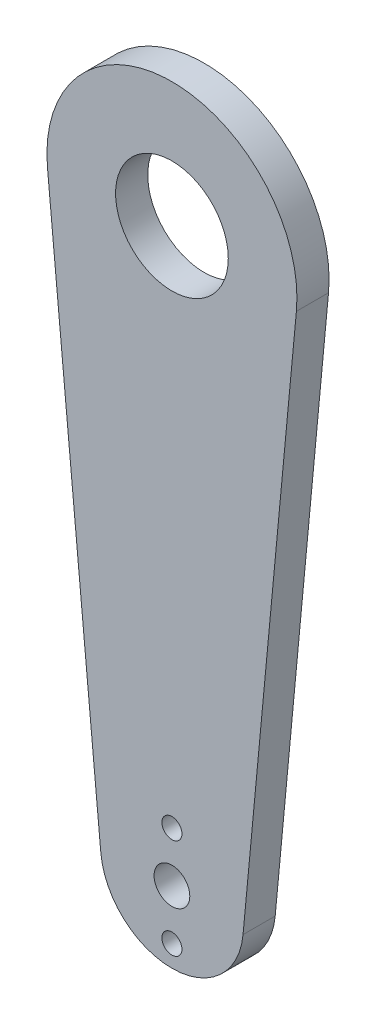
ISO-10303-21;
HEADER;
FILE_DESCRIPTION(('STEP AP214'),'2;1');
FILE_NAME('part.step','',(''),(''),'','','');
FILE_SCHEMA(('AUTOMOTIVE_DESIGN { 1 0 10303 214 1 1 1 1 }'));
ENDSEC;
DATA;
#1=APPLICATION_CONTEXT('core data for automotive mechanical design processes');
#2=APPLICATION_PROTOCOL_DEFINITION('international standard','automotive_design',2000,#1);
#3=PRODUCT_CONTEXT('',#1,'mechanical');
#4=PRODUCT('Part','Part','',(#3));
#5=PRODUCT_RELATED_PRODUCT_CATEGORY('part','',(#4));
#6=PRODUCT_DEFINITION_FORMATION('','',#4);
#7=PRODUCT_DEFINITION_CONTEXT('part definition',#1,'design');
#8=PRODUCT_DEFINITION('design','',#6,#7);
#9=PRODUCT_DEFINITION_SHAPE('','',#8);
#10=(LENGTH_UNIT() NAMED_UNIT(*) SI_UNIT(.MILLI.,.METRE.));
#11=(NAMED_UNIT(*) PLANE_ANGLE_UNIT() SI_UNIT($,.RADIAN.));
#12=(NAMED_UNIT(*) SI_UNIT($,.STERADIAN.) SOLID_ANGLE_UNIT());
#13=UNCERTAINTY_MEASURE_WITH_UNIT(LENGTH_MEASURE(1.E-05),#10,'distance_accuracy_value','');
#14=(GEOMETRIC_REPRESENTATION_CONTEXT(3) GLOBAL_UNCERTAINTY_ASSIGNED_CONTEXT((#13)) GLOBAL_UNIT_ASSIGNED_CONTEXT((#10,
#11,#12)) REPRESENTATION_CONTEXT('',''));
#15=CARTESIAN_POINT('',(0.,0.,0.));
#16=DIRECTION('',(0.,0.,1.));
#17=DIRECTION('',(1.,0.,0.));
#18=AXIS2_PLACEMENT_3D('',#15,#16,#17);
#19=CARTESIAN_POINT('',(0.,0.,4.5));
#20=DIRECTION('',(0.,0.,1.));
#21=DIRECTION('',(1.,0.,0.));
#22=AXIS2_PLACEMENT_3D('',#19,#20,#21);
#23=PLANE('',#22);
#24=CARTESIAN_POINT('',(0.,-7.,4.5));
#25=DIRECTION('',(0.,0.,1.));
#26=DIRECTION('',(1.,0.,0.));
#27=AXIS2_PLACEMENT_3D('',#24,#25,#26);
#28=CIRCLE('',#27,1.4);
#29=CARTESIAN_POINT('',(1.4,-7.,4.5));
#30=VERTEX_POINT('',#29);
#31=EDGE_CURVE('E129',#30,#30,#28,.T.);
#32=ORIENTED_EDGE('',*,*,#31,.F.);
#33=EDGE_LOOP('',(#32));
#34=FACE_BOUND('',#33,.T.);
#35=CARTESIAN_POINT('',(0.,0.,4.5));
#36=DIRECTION('',(0.,0.,1.));
#37=DIRECTION('',(1.,0.,0.));
#38=AXIS2_PLACEMENT_3D('',#35,#36,#37);
#39=CIRCLE('',#38,2.5);
#40=CARTESIAN_POINT('',(2.5,0.,4.5));
#41=VERTEX_POINT('',#40);
#42=EDGE_CURVE('E108',#41,#41,#39,.T.);
#43=ORIENTED_EDGE('',*,*,#42,.F.);
#44=EDGE_LOOP('',(#43));
#45=FACE_BOUND('',#44,.T.);
#46=CARTESIAN_POINT('',(0.,0.,4.5));
#47=DIRECTION('',(0.,0.,1.));
#48=DIRECTION('',(1.,0.,0.));
#49=AXIS2_PLACEMENT_3D('',#46,#47,#48);
#50=CIRCLE('',#49,10.);
#51=CARTESIAN_POINT('',(-9.95595770129625,-0.937500000000001,4.5));
#52=VERTEX_POINT('',#51);
#53=CARTESIAN_POINT('',(9.95595770129625,-0.937500000000001,4.5));
#54=VERTEX_POINT('',#53);
#55=EDGE_CURVE('E93',#52,#54,#50,.T.);
#56=ORIENTED_EDGE('',*,*,#55,.T.);
#57=DIRECTION('',(0.0937500000000001,0.995595770129624,0.));
#58=VECTOR('',#57,1.);
#59=CARTESIAN_POINT('',(17.4229259772684,78.359375,4.5));
#60=LINE('',#59,#58);
#61=CARTESIAN_POINT('',(17.4229259772684,78.359375,4.5));
#62=VERTEX_POINT('',#61);
#63=EDGE_CURVE('E88',#54,#62,#60,.T.);
#64=ORIENTED_EDGE('',*,*,#63,.T.);
#65=CARTESIAN_POINT('',(0.,80.,4.5));
#66=DIRECTION('',(0.,0.,1.));
#67=DIRECTION('',(1.,0.,0.));
#68=AXIS2_PLACEMENT_3D('',#65,#66,#67);
#69=CIRCLE('',#68,17.5);
#70=CARTESIAN_POINT('',(-17.4229259772684,78.359375,4.5));
#71=VERTEX_POINT('',#70);
#72=EDGE_CURVE('E91',#62,#71,#69,.T.);
#73=ORIENTED_EDGE('',*,*,#72,.T.);
#74=DIRECTION('',(0.0937500000000001,-0.995595770129624,0.));
#75=VECTOR('',#74,1.);
#76=CARTESIAN_POINT('',(-9.95595770129625,-0.937500000000001,4.5));
#77=LINE('',#76,#75);
#78=EDGE_CURVE('E58',#71,#52,#77,.T.);
#79=ORIENTED_EDGE('',*,*,#78,.T.);
#80=EDGE_LOOP('',(#56,#64,#73,#79));
#81=FACE_BOUND('',#80,.T.);
#82=CARTESIAN_POINT('',(0.,7.,4.5));
#83=DIRECTION('',(0.,0.,1.));
#84=DIRECTION('',(1.,0.,0.));
#85=AXIS2_PLACEMENT_3D('',#82,#83,#84);
#86=CIRCLE('',#85,1.4);
#87=CARTESIAN_POINT('',(1.4,7.,4.5));
#88=VERTEX_POINT('',#87);
#89=EDGE_CURVE('E123',#88,#88,#86,.T.);
#90=ORIENTED_EDGE('',*,*,#89,.F.);
#91=EDGE_LOOP('',(#90));
#92=FACE_BOUND('',#91,.T.);
#93=CARTESIAN_POINT('',(0.,80.,4.5));
#94=DIRECTION('',(0.,0.,1.));
#95=DIRECTION('',(1.,0.,0.));
#96=AXIS2_PLACEMENT_3D('',#93,#94,#95);
#97=CIRCLE('',#96,7.8875);
#98=CARTESIAN_POINT('',(7.8875,80.,4.5));
#99=VERTEX_POINT('',#98);
#100=EDGE_CURVE('E135',#99,#99,#97,.T.);
#101=ORIENTED_EDGE('',*,*,#100,.F.);
#102=EDGE_LOOP('',(#101));
#103=FACE_BOUND('',#102,.T.);
#104=ADVANCED_FACE('F41',(#34,#45,#81,#92,#103),#23,.T.);
#105=CARTESIAN_POINT('',(0.,0.,0.));
#106=DIRECTION('',(0.,0.,1.));
#107=DIRECTION('',(1.,0.,0.));
#108=AXIS2_PLACEMENT_3D('',#105,#106,#107);
#109=PLANE('',#108);
#110=CARTESIAN_POINT('',(0.,0.,0.));
#111=DIRECTION('',(0.,0.,1.));
#112=DIRECTION('',(1.,0.,0.));
#113=AXIS2_PLACEMENT_3D('',#110,#111,#112);
#114=CIRCLE('',#113,10.);
#115=CARTESIAN_POINT('',(-9.95595770129625,-0.937500000000001,0.));
#116=VERTEX_POINT('',#115);
#117=CARTESIAN_POINT('',(9.95595770129625,-0.937500000000001,0.));
#118=VERTEX_POINT('',#117);
#119=EDGE_CURVE('E105',#116,#118,#114,.T.);
#120=ORIENTED_EDGE('',*,*,#119,.F.);
#121=DIRECTION('',(0.0937500000000001,-0.995595770129624,0.));
#122=VECTOR('',#121,1.);
#123=CARTESIAN_POINT('',(-9.95595770129625,-0.937500000000001,0.));
#124=LINE('',#123,#122);
#125=CARTESIAN_POINT('',(-17.4229259772684,78.359375,0.));
#126=VERTEX_POINT('',#125);
#127=EDGE_CURVE('E81',#126,#116,#124,.T.);
#128=ORIENTED_EDGE('',*,*,#127,.F.);
#129=CARTESIAN_POINT('',(0.,80.,0.));
#130=DIRECTION('',(0.,0.,1.));
#131=DIRECTION('',(1.,0.,0.));
#132=AXIS2_PLACEMENT_3D('',#129,#130,#131);
#133=CIRCLE('',#132,17.5);
#134=CARTESIAN_POINT('',(17.4229259772684,78.359375,0.));
#135=VERTEX_POINT('',#134);
#136=EDGE_CURVE('E75',#135,#126,#133,.T.);
#137=ORIENTED_EDGE('',*,*,#136,.F.);
#138=DIRECTION('',(0.0937500000000001,0.995595770129624,0.));
#139=VECTOR('',#138,1.);
#140=CARTESIAN_POINT('',(17.4229259772684,78.359375,0.));
#141=LINE('',#140,#139);
#142=EDGE_CURVE('E97',#118,#135,#141,.T.);
#143=ORIENTED_EDGE('',*,*,#142,.F.);
#144=EDGE_LOOP('',(#120,#128,#137,#143));
#145=FACE_BOUND('',#144,.T.);
#146=CARTESIAN_POINT('',(0.,0.,0.));
#147=DIRECTION('',(0.,0.,1.));
#148=DIRECTION('',(1.,0.,0.));
#149=AXIS2_PLACEMENT_3D('',#146,#147,#148);
#150=CIRCLE('',#149,2.5);
#151=CARTESIAN_POINT('',(2.5,0.,0.));
#152=VERTEX_POINT('',#151);
#153=EDGE_CURVE('E120',#152,#152,#150,.T.);
#154=ORIENTED_EDGE('',*,*,#153,.T.);
#155=EDGE_LOOP('',(#154));
#156=FACE_BOUND('',#155,.T.);
#157=CARTESIAN_POINT('',(0.,7.,0.));
#158=DIRECTION('',(0.,0.,1.));
#159=DIRECTION('',(1.,0.,0.));
#160=AXIS2_PLACEMENT_3D('',#157,#158,#159);
#161=CIRCLE('',#160,1.4);
#162=CARTESIAN_POINT('',(1.4,7.,0.));
#163=VERTEX_POINT('',#162);
#164=EDGE_CURVE('E126',#163,#163,#161,.T.);
#165=ORIENTED_EDGE('',*,*,#164,.T.);
#166=EDGE_LOOP('',(#165));
#167=FACE_BOUND('',#166,.T.);
#168=CARTESIAN_POINT('',(0.,-7.,0.));
#169=DIRECTION('',(0.,0.,1.));
#170=DIRECTION('',(1.,0.,0.));
#171=AXIS2_PLACEMENT_3D('',#168,#169,#170);
#172=CIRCLE('',#171,1.4);
#173=CARTESIAN_POINT('',(1.4,-7.,0.));
#174=VERTEX_POINT('',#173);
#175=EDGE_CURVE('E132',#174,#174,#172,.T.);
#176=ORIENTED_EDGE('',*,*,#175,.T.);
#177=EDGE_LOOP('',(#176));
#178=FACE_BOUND('',#177,.T.);
#179=CARTESIAN_POINT('',(0.,80.,0.));
#180=DIRECTION('',(0.,0.,1.));
#181=DIRECTION('',(1.,0.,0.));
#182=AXIS2_PLACEMENT_3D('',#179,#180,#181);
#183=CIRCLE('',#182,7.8875);
#184=CARTESIAN_POINT('',(7.8875,80.,0.));
#185=VERTEX_POINT('',#184);
#186=EDGE_CURVE('E138',#185,#185,#183,.T.);
#187=ORIENTED_EDGE('',*,*,#186,.T.);
#188=EDGE_LOOP('',(#187));
#189=FACE_BOUND('',#188,.T.);
#190=ADVANCED_FACE('F116',(#145,#156,#167,#178,#189),#109,.F.);
#191=CARTESIAN_POINT('',(0.,0.,4.5));
#192=DIRECTION('',(0.,0.,-1.));
#193=DIRECTION('',(-1.,0.,0.));
#194=AXIS2_PLACEMENT_3D('',#191,#192,#193);
#195=CYLINDRICAL_SURFACE('',#194,10.);
#196=ORIENTED_EDGE('',*,*,#119,.T.);
#197=DIRECTION('',(0.,0.,-1.));
#198=VECTOR('',#197,1.);
#199=CARTESIAN_POINT('',(9.95595770129625,-0.937500000000001,4.5));
#200=LINE('',#199,#198);
#201=EDGE_CURVE('E11',#54,#118,#200,.T.);
#202=ORIENTED_EDGE('',*,*,#201,.F.);
#203=ORIENTED_EDGE('',*,*,#55,.F.);
#204=DIRECTION('',(0.,0.,-1.));
#205=VECTOR('',#204,1.);
#206=CARTESIAN_POINT('',(-9.95595770129625,-0.937500000000001,4.5));
#207=LINE('',#206,#205);
#208=EDGE_CURVE('E101',#52,#116,#207,.T.);
#209=ORIENTED_EDGE('',*,*,#208,.T.);
#210=EDGE_LOOP('',(#196,#202,#203,#209));
#211=FACE_BOUND('',#210,.T.);
#212=ADVANCED_FACE('F43',(#211),#195,.T.);
#213=CARTESIAN_POINT('',(17.4229259772684,78.359375,4.5));
#214=DIRECTION('',(-0.995595770129624,0.0937500000000001,0.));
#215=DIRECTION('',(-0.0937500000000001,-0.995595770129625,0.));
#216=AXIS2_PLACEMENT_3D('',#213,#214,#215);
#217=PLANE('',#216);
#218=ORIENTED_EDGE('',*,*,#142,.T.);
#219=DIRECTION('',(0.,0.,-1.));
#220=VECTOR('',#219,1.);
#221=CARTESIAN_POINT('',(17.4229259772684,78.359375,4.5));
#222=LINE('',#221,#220);
#223=EDGE_CURVE('E50',#62,#135,#222,.T.);
#224=ORIENTED_EDGE('',*,*,#223,.F.);
#225=ORIENTED_EDGE('',*,*,#63,.F.);
#226=ORIENTED_EDGE('',*,*,#201,.T.);
#227=EDGE_LOOP('',(#218,#224,#225,#226));
#228=FACE_BOUND('',#227,.T.);
#229=ADVANCED_FACE('F96',(#228),#217,.F.);
#230=CARTESIAN_POINT('',(0.,80.,4.5));
#231=DIRECTION('',(0.,0.,-1.));
#232=DIRECTION('',(-1.,0.,0.));
#233=AXIS2_PLACEMENT_3D('',#230,#231,#232);
#234=CYLINDRICAL_SURFACE('',#233,17.5);
#235=ORIENTED_EDGE('',*,*,#136,.T.);
#236=DIRECTION('',(0.,0.,-1.));
#237=VECTOR('',#236,1.);
#238=CARTESIAN_POINT('',(-17.4229259772684,78.359375,4.5));
#239=LINE('',#238,#237);
#240=EDGE_CURVE('E98',#71,#126,#239,.T.);
#241=ORIENTED_EDGE('',*,*,#240,.F.);
#242=ORIENTED_EDGE('',*,*,#72,.F.);
#243=ORIENTED_EDGE('',*,*,#223,.T.);
#244=EDGE_LOOP('',(#235,#241,#242,#243));
#245=FACE_BOUND('',#244,.T.);
#246=ADVANCED_FACE('F99',(#245),#234,.T.);
#247=CARTESIAN_POINT('',(-9.95595770129625,-0.937500000000001,4.5));
#248=DIRECTION('',(0.995595770129624,0.0937500000000001,0.));
#249=DIRECTION('',(-0.0937500000000001,0.995595770129625,0.));
#250=AXIS2_PLACEMENT_3D('',#247,#248,#249);
#251=PLANE('',#250);
#252=ORIENTED_EDGE('',*,*,#127,.T.);
#253=ORIENTED_EDGE('',*,*,#208,.F.);
#254=ORIENTED_EDGE('',*,*,#78,.F.);
#255=ORIENTED_EDGE('',*,*,#240,.T.);
#256=EDGE_LOOP('',(#252,#253,#254,#255));
#257=FACE_BOUND('',#256,.T.);
#258=ADVANCED_FACE('F113',(#257),#251,.F.);
#259=CARTESIAN_POINT('',(0.,0.,4.5));
#260=DIRECTION('',(0.,0.,-1.));
#261=DIRECTION('',(-1.,0.,0.));
#262=AXIS2_PLACEMENT_3D('',#259,#260,#261);
#263=CYLINDRICAL_SURFACE('',#262,2.5);
#264=ORIENTED_EDGE('',*,*,#42,.T.);
#265=EDGE_LOOP('',(#264));
#266=FACE_BOUND('',#265,.T.);
#267=ORIENTED_EDGE('',*,*,#153,.F.);
#268=EDGE_LOOP('',(#267));
#269=FACE_BOUND('',#268,.T.);
#270=ADVANCED_FACE('F157',(#266,#269),#263,.F.);
#271=CARTESIAN_POINT('',(0.,7.,4.5));
#272=DIRECTION('',(0.,0.,-1.));
#273=DIRECTION('',(-1.,0.,0.));
#274=AXIS2_PLACEMENT_3D('',#271,#272,#273);
#275=CYLINDRICAL_SURFACE('',#274,1.4);
#276=ORIENTED_EDGE('',*,*,#89,.T.);
#277=EDGE_LOOP('',(#276));
#278=FACE_BOUND('',#277,.T.);
#279=ORIENTED_EDGE('',*,*,#164,.F.);
#280=EDGE_LOOP('',(#279));
#281=FACE_BOUND('',#280,.T.);
#282=ADVANCED_FACE('F202',(#278,#281),#275,.F.);
#283=CARTESIAN_POINT('',(0.,-7.,4.5));
#284=DIRECTION('',(0.,0.,-1.));
#285=DIRECTION('',(-1.,0.,0.));
#286=AXIS2_PLACEMENT_3D('',#283,#284,#285);
#287=CYLINDRICAL_SURFACE('',#286,1.4);
#288=ORIENTED_EDGE('',*,*,#31,.T.);
#289=EDGE_LOOP('',(#288));
#290=FACE_BOUND('',#289,.T.);
#291=ORIENTED_EDGE('',*,*,#175,.F.);
#292=EDGE_LOOP('',(#291));
#293=FACE_BOUND('',#292,.T.);
#294=ADVANCED_FACE('F210',(#290,#293),#287,.F.);
#295=CARTESIAN_POINT('',(0.,80.,4.5));
#296=DIRECTION('',(0.,0.,-1.));
#297=DIRECTION('',(-1.,0.,0.));
#298=AXIS2_PLACEMENT_3D('',#295,#296,#297);
#299=CYLINDRICAL_SURFACE('',#298,7.8875);
#300=ORIENTED_EDGE('',*,*,#100,.T.);
#301=EDGE_LOOP('',(#300));
#302=FACE_BOUND('',#301,.T.);
#303=ORIENTED_EDGE('',*,*,#186,.F.);
#304=EDGE_LOOP('',(#303));
#305=FACE_BOUND('',#304,.T.);
#306=ADVANCED_FACE('F144',(#302,#305),#299,.F.);
#307=CLOSED_SHELL('',(#104,#190,#212,#229,#246,#258,#270,#282,#294,#306));
#308=MANIFOLD_SOLID_BREP('B2',#307);
#309=ADVANCED_BREP_SHAPE_REPRESENTATION('',(#18,#308),#14);
#310=SHAPE_DEFINITION_REPRESENTATION(#9,#309);
ENDSEC;
END-ISO-10303-21;
